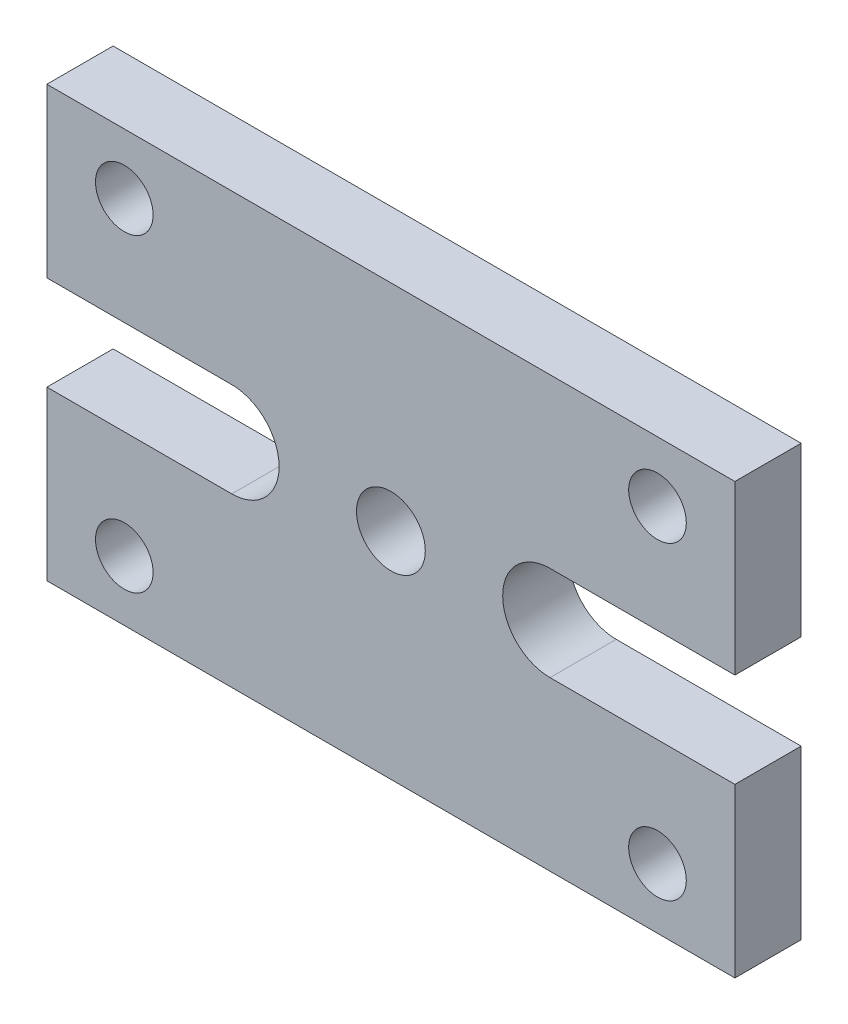
ISO-10303-21;
HEADER;
FILE_DESCRIPTION(('STEP AP214'),'2;1');
FILE_NAME('part.step','',(''),(''),'','','');
FILE_SCHEMA(('AUTOMOTIVE_DESIGN { 1 0 10303 214 1 1 1 1 }'));
ENDSEC;
DATA;
#1=APPLICATION_CONTEXT('core data for automotive mechanical design processes');
#2=APPLICATION_PROTOCOL_DEFINITION('international standard','automotive_design',2000,#1);
#3=PRODUCT_CONTEXT('',#1,'mechanical');
#4=PRODUCT('Part','Part','',(#3));
#5=PRODUCT_RELATED_PRODUCT_CATEGORY('part','',(#4));
#6=PRODUCT_DEFINITION_FORMATION('','',#4);
#7=PRODUCT_DEFINITION_CONTEXT('part definition',#1,'design');
#8=PRODUCT_DEFINITION('design','',#6,#7);
#9=PRODUCT_DEFINITION_SHAPE('','',#8);
#10=(LENGTH_UNIT() NAMED_UNIT(*) SI_UNIT(.MILLI.,.METRE.));
#11=(NAMED_UNIT(*) PLANE_ANGLE_UNIT() SI_UNIT($,.RADIAN.));
#12=(NAMED_UNIT(*) SI_UNIT($,.STERADIAN.) SOLID_ANGLE_UNIT());
#13=UNCERTAINTY_MEASURE_WITH_UNIT(LENGTH_MEASURE(1.E-05),#10,'distance_accuracy_value','');
#14=(GEOMETRIC_REPRESENTATION_CONTEXT(3) GLOBAL_UNCERTAINTY_ASSIGNED_CONTEXT((#13)) GLOBAL_UNIT_ASSIGNED_CONTEXT((#10,
#11,#12)) REPRESENTATION_CONTEXT('',''));
#15=CARTESIAN_POINT('',(0.,0.,0.));
#16=DIRECTION('',(0.,0.,1.));
#17=DIRECTION('',(1.,0.,0.));
#18=AXIS2_PLACEMENT_3D('',#15,#16,#17);
#19=CARTESIAN_POINT('',(-40.,25.,7.7));
#20=DIRECTION('',(1.,0.,0.));
#21=DIRECTION('',(0.,1.,0.));
#22=AXIS2_PLACEMENT_3D('',#19,#20,#21);
#23=PLANE('',#22);
#24=DIRECTION('',(0.,-1.,0.));
#25=VECTOR('',#24,1.);
#26=CARTESIAN_POINT('',(-40.,25.,0.));
#27=LINE('',#26,#25);
#28=CARTESIAN_POINT('',(-40.,25.,0.));
#29=VERTEX_POINT('',#28);
#30=CARTESIAN_POINT('',(-40.,5.5,0.));
#31=VERTEX_POINT('',#30);
#32=EDGE_CURVE('E152',#29,#31,#27,.T.);
#33=ORIENTED_EDGE('',*,*,#32,.T.);
#34=DIRECTION('',(0.,0.,-1.));
#35=VECTOR('',#34,1.);
#36=CARTESIAN_POINT('',(-40.,5.5,7.7));
#37=LINE('',#36,#35);
#38=CARTESIAN_POINT('',(-40.,5.5,7.7));
#39=VERTEX_POINT('',#38);
#40=EDGE_CURVE('E11',#39,#31,#37,.T.);
#41=ORIENTED_EDGE('',*,*,#40,.F.);
#42=DIRECTION('',(0.,-1.,0.));
#43=VECTOR('',#42,1.);
#44=CARTESIAN_POINT('',(-40.,25.,7.7));
#45=LINE('',#44,#43);
#46=CARTESIAN_POINT('',(-40.,25.,7.7));
#47=VERTEX_POINT('',#46);
#48=EDGE_CURVE('E175',#47,#39,#45,.T.);
#49=ORIENTED_EDGE('',*,*,#48,.F.);
#50=DIRECTION('',(0.,0.,-1.));
#51=VECTOR('',#50,1.);
#52=CARTESIAN_POINT('',(-40.,25.,7.7));
#53=LINE('',#52,#51);
#54=EDGE_CURVE('E148',#47,#29,#53,.T.);
#55=ORIENTED_EDGE('',*,*,#54,.T.);
#56=EDGE_LOOP('',(#33,#41,#49,#55));
#57=FACE_BOUND('',#56,.T.);
#58=ADVANCED_FACE('F32',(#57),#23,.F.);
#59=CARTESIAN_POINT('',(-18.5,5.5,7.7));
#60=DIRECTION('',(0.,1.,0.));
#61=DIRECTION('',(-1.,0.,0.));
#62=AXIS2_PLACEMENT_3D('',#59,#60,#61);
#63=PLANE('',#62);
#64=DIRECTION('',(1.,0.,0.));
#65=VECTOR('',#64,1.);
#66=CARTESIAN_POINT('',(-18.5,5.5,0.));
#67=LINE('',#66,#65);
#68=CARTESIAN_POINT('',(-18.5,5.5,0.));
#69=VERTEX_POINT('',#68);
#70=EDGE_CURVE('E155',#31,#69,#67,.T.);
#71=ORIENTED_EDGE('',*,*,#70,.T.);
#72=DIRECTION('',(0.,0.,-1.));
#73=VECTOR('',#72,1.);
#74=CARTESIAN_POINT('',(-18.5,5.5,7.7));
#75=LINE('',#74,#73);
#76=CARTESIAN_POINT('',(-18.5,5.5,7.7));
#77=VERTEX_POINT('',#76);
#78=EDGE_CURVE('E40',#77,#69,#75,.T.);
#79=ORIENTED_EDGE('',*,*,#78,.F.);
#80=DIRECTION('',(1.,0.,0.));
#81=VECTOR('',#80,1.);
#82=CARTESIAN_POINT('',(-18.5,5.5,7.7));
#83=LINE('',#82,#81);
#84=EDGE_CURVE('E103',#39,#77,#83,.T.);
#85=ORIENTED_EDGE('',*,*,#84,.F.);
#86=ORIENTED_EDGE('',*,*,#40,.T.);
#87=EDGE_LOOP('',(#71,#79,#85,#86));
#88=FACE_BOUND('',#87,.T.);
#89=ADVANCED_FACE('F254',(#88),#63,.F.);
#90=CARTESIAN_POINT('',(-18.5,0.,7.7));
#91=DIRECTION('',(0.,0.,-1.));
#92=DIRECTION('',(-1.,0.,0.));
#93=AXIS2_PLACEMENT_3D('',#90,#91,#92);
#94=CYLINDRICAL_SURFACE('',#93,5.5);
#95=CARTESIAN_POINT('',(-18.5,0.,0.));
#96=DIRECTION('',(0.,0.,-1.));
#97=DIRECTION('',(1.,0.,0.));
#98=AXIS2_PLACEMENT_3D('',#95,#96,#97);
#99=CIRCLE('',#98,5.5);
#100=CARTESIAN_POINT('',(-18.5,-5.5,0.));
#101=VERTEX_POINT('',#100);
#102=EDGE_CURVE('E158',#69,#101,#99,.T.);
#103=ORIENTED_EDGE('',*,*,#102,.T.);
#104=DIRECTION('',(0.,0.,-1.));
#105=VECTOR('',#104,1.);
#106=CARTESIAN_POINT('',(-18.5,-5.5,7.7));
#107=LINE('',#106,#105);
#108=CARTESIAN_POINT('',(-18.5,-5.5,7.7));
#109=VERTEX_POINT('',#108);
#110=EDGE_CURVE('E194',#109,#101,#107,.T.);
#111=ORIENTED_EDGE('',*,*,#110,.F.);
#112=CARTESIAN_POINT('',(-18.5,0.,7.7));
#113=DIRECTION('',(0.,0.,-1.));
#114=DIRECTION('',(1.,0.,0.));
#115=AXIS2_PLACEMENT_3D('',#112,#113,#114);
#116=CIRCLE('',#115,5.5);
#117=EDGE_CURVE('E202',#77,#109,#116,.T.);
#118=ORIENTED_EDGE('',*,*,#117,.F.);
#119=ORIENTED_EDGE('',*,*,#78,.T.);
#120=EDGE_LOOP('',(#103,#111,#118,#119));
#121=FACE_BOUND('',#120,.T.);
#122=ADVANCED_FACE('F200',(#121),#94,.F.);
#123=CARTESIAN_POINT('',(-18.5,-5.5,7.7));
#124=DIRECTION('',(0.,-1.,0.));
#125=DIRECTION('',(1.,0.,0.));
#126=AXIS2_PLACEMENT_3D('',#123,#124,#125);
#127=PLANE('',#126);
#128=DIRECTION('',(-1.,0.,0.));
#129=VECTOR('',#128,1.);
#130=CARTESIAN_POINT('',(-18.5,-5.5,0.));
#131=LINE('',#130,#129);
#132=CARTESIAN_POINT('',(-40.,-5.5,0.));
#133=VERTEX_POINT('',#132);
#134=EDGE_CURVE('E160',#101,#133,#131,.T.);
#135=ORIENTED_EDGE('',*,*,#134,.T.);
#136=DIRECTION('',(0.,0.,-1.));
#137=VECTOR('',#136,1.);
#138=CARTESIAN_POINT('',(-40.,-5.5,7.7));
#139=LINE('',#138,#137);
#140=CARTESIAN_POINT('',(-40.,-5.5,7.7));
#141=VERTEX_POINT('',#140);
#142=EDGE_CURVE('E191',#141,#133,#139,.T.);
#143=ORIENTED_EDGE('',*,*,#142,.F.);
#144=DIRECTION('',(-1.,0.,0.));
#145=VECTOR('',#144,1.);
#146=CARTESIAN_POINT('',(-18.5,-5.5,7.7));
#147=LINE('',#146,#145);
#148=EDGE_CURVE('E220',#109,#141,#147,.T.);
#149=ORIENTED_EDGE('',*,*,#148,.F.);
#150=ORIENTED_EDGE('',*,*,#110,.T.);
#151=EDGE_LOOP('',(#135,#143,#149,#150));
#152=FACE_BOUND('',#151,.T.);
#153=ADVANCED_FACE('F211',(#152),#127,.F.);
#154=CARTESIAN_POINT('',(-40.,-5.5,7.7));
#155=DIRECTION('',(1.,0.,0.));
#156=DIRECTION('',(0.,0.,-1.));
#157=AXIS2_PLACEMENT_3D('',#154,#155,#156);
#158=PLANE('',#157);
#159=DIRECTION('',(0.,-1.,0.));
#160=VECTOR('',#159,1.);
#161=CARTESIAN_POINT('',(-40.,-5.5,0.));
#162=LINE('',#161,#160);
#163=CARTESIAN_POINT('',(-40.,-25.,0.));
#164=VERTEX_POINT('',#163);
#165=EDGE_CURVE('E162',#133,#164,#162,.T.);
#166=ORIENTED_EDGE('',*,*,#165,.T.);
#167=DIRECTION('',(0.,0.,-1.));
#168=VECTOR('',#167,1.);
#169=CARTESIAN_POINT('',(-40.,-25.,7.7));
#170=LINE('',#169,#168);
#171=CARTESIAN_POINT('',(-40.,-25.,7.7));
#172=VERTEX_POINT('',#171);
#173=EDGE_CURVE('E188',#172,#164,#170,.T.);
#174=ORIENTED_EDGE('',*,*,#173,.F.);
#175=DIRECTION('',(0.,-1.,0.));
#176=VECTOR('',#175,1.);
#177=CARTESIAN_POINT('',(-40.,-5.5,7.7));
#178=LINE('',#177,#176);
#179=EDGE_CURVE('E217',#141,#172,#178,.T.);
#180=ORIENTED_EDGE('',*,*,#179,.F.);
#181=ORIENTED_EDGE('',*,*,#142,.T.);
#182=EDGE_LOOP('',(#166,#174,#180,#181));
#183=FACE_BOUND('',#182,.T.);
#184=ADVANCED_FACE('F215',(#183),#158,.F.);
#185=CARTESIAN_POINT('',(-40.,-25.,7.7));
#186=DIRECTION('',(0.,1.,0.));
#187=DIRECTION('',(0.,0.,1.));
#188=AXIS2_PLACEMENT_3D('',#185,#186,#187);
#189=PLANE('',#188);
#190=DIRECTION('',(1.,0.,0.));
#191=VECTOR('',#190,1.);
#192=CARTESIAN_POINT('',(-40.,-25.,0.));
#193=LINE('',#192,#191);
#194=CARTESIAN_POINT('',(40.,-25.,0.));
#195=VERTEX_POINT('',#194);
#196=EDGE_CURVE('E164',#164,#195,#193,.T.);
#197=ORIENTED_EDGE('',*,*,#196,.T.);
#198=DIRECTION('',(0.,0.,-1.));
#199=VECTOR('',#198,1.);
#200=CARTESIAN_POINT('',(40.,-25.,7.7));
#201=LINE('',#200,#199);
#202=CARTESIAN_POINT('',(40.,-25.,7.7));
#203=VERTEX_POINT('',#202);
#204=EDGE_CURVE('E185',#203,#195,#201,.T.);
#205=ORIENTED_EDGE('',*,*,#204,.F.);
#206=DIRECTION('',(1.,0.,0.));
#207=VECTOR('',#206,1.);
#208=CARTESIAN_POINT('',(-40.,-25.,7.7));
#209=LINE('',#208,#207);
#210=EDGE_CURVE('E219',#172,#203,#209,.T.);
#211=ORIENTED_EDGE('',*,*,#210,.F.);
#212=ORIENTED_EDGE('',*,*,#173,.T.);
#213=EDGE_LOOP('',(#197,#205,#211,#212));
#214=FACE_BOUND('',#213,.T.);
#215=ADVANCED_FACE('F267',(#214),#189,.F.);
#216=CARTESIAN_POINT('',(40.,-5.5,7.7));
#217=DIRECTION('',(-1.,0.,0.));
#218=DIRECTION('',(0.,0.,1.));
#219=AXIS2_PLACEMENT_3D('',#216,#217,#218);
#220=PLANE('',#219);
#221=DIRECTION('',(0.,1.,0.));
#222=VECTOR('',#221,1.);
#223=CARTESIAN_POINT('',(40.,-5.5,0.));
#224=LINE('',#223,#222);
#225=CARTESIAN_POINT('',(40.,-5.5,0.));
#226=VERTEX_POINT('',#225);
#227=EDGE_CURVE('E166',#195,#226,#224,.T.);
#228=ORIENTED_EDGE('',*,*,#227,.T.);
#229=DIRECTION('',(0.,0.,-1.));
#230=VECTOR('',#229,1.);
#231=CARTESIAN_POINT('',(40.,-5.5,7.7));
#232=LINE('',#231,#230);
#233=CARTESIAN_POINT('',(40.,-5.5,7.7));
#234=VERTEX_POINT('',#233);
#235=EDGE_CURVE('E182',#234,#226,#232,.T.);
#236=ORIENTED_EDGE('',*,*,#235,.F.);
#237=DIRECTION('',(0.,1.,0.));
#238=VECTOR('',#237,1.);
#239=CARTESIAN_POINT('',(40.,-5.5,7.7));
#240=LINE('',#239,#238);
#241=EDGE_CURVE('E222',#203,#234,#240,.T.);
#242=ORIENTED_EDGE('',*,*,#241,.F.);
#243=ORIENTED_EDGE('',*,*,#204,.T.);
#244=EDGE_LOOP('',(#228,#236,#242,#243));
#245=FACE_BOUND('',#244,.T.);
#246=ADVANCED_FACE('F270',(#245),#220,.F.);
#247=CARTESIAN_POINT('',(18.5,-5.5,7.7));
#248=DIRECTION('',(0.,-1.,0.));
#249=DIRECTION('',(1.,0.,0.));
#250=AXIS2_PLACEMENT_3D('',#247,#248,#249);
#251=PLANE('',#250);
#252=DIRECTION('',(-1.,0.,0.));
#253=VECTOR('',#252,1.);
#254=CARTESIAN_POINT('',(18.5,-5.5,0.));
#255=LINE('',#254,#253);
#256=CARTESIAN_POINT('',(18.5,-5.5,0.));
#257=VERTEX_POINT('',#256);
#258=EDGE_CURVE('E168',#226,#257,#255,.T.);
#259=ORIENTED_EDGE('',*,*,#258,.T.);
#260=DIRECTION('',(0.,0.,-1.));
#261=VECTOR('',#260,1.);
#262=CARTESIAN_POINT('',(18.5,-5.5,7.7));
#263=LINE('',#262,#261);
#264=CARTESIAN_POINT('',(18.5,-5.5,7.7));
#265=VERTEX_POINT('',#264);
#266=EDGE_CURVE('E179',#265,#257,#263,.T.);
#267=ORIENTED_EDGE('',*,*,#266,.F.);
#268=DIRECTION('',(-1.,0.,0.));
#269=VECTOR('',#268,1.);
#270=CARTESIAN_POINT('',(18.5,-5.5,7.7));
#271=LINE('',#270,#269);
#272=EDGE_CURVE('E228',#234,#265,#271,.T.);
#273=ORIENTED_EDGE('',*,*,#272,.F.);
#274=ORIENTED_EDGE('',*,*,#235,.T.);
#275=EDGE_LOOP('',(#259,#267,#273,#274));
#276=FACE_BOUND('',#275,.T.);
#277=ADVANCED_FACE('F234',(#276),#251,.F.);
#278=CARTESIAN_POINT('',(18.5,0.,7.7));
#279=DIRECTION('',(0.,0.,-1.));
#280=DIRECTION('',(-1.,0.,0.));
#281=AXIS2_PLACEMENT_3D('',#278,#279,#280);
#282=CYLINDRICAL_SURFACE('',#281,5.5);
#283=CARTESIAN_POINT('',(18.5,0.,0.));
#284=DIRECTION('',(0.,0.,-1.));
#285=DIRECTION('',(1.,0.,0.));
#286=AXIS2_PLACEMENT_3D('',#283,#284,#285);
#287=CIRCLE('',#286,5.5);
#288=CARTESIAN_POINT('',(18.5,5.5,0.));
#289=VERTEX_POINT('',#288);
#290=EDGE_CURVE('E170',#257,#289,#287,.T.);
#291=ORIENTED_EDGE('',*,*,#290,.T.);
#292=DIRECTION('',(0.,0.,-1.));
#293=VECTOR('',#292,1.);
#294=CARTESIAN_POINT('',(18.5,5.5,7.7));
#295=LINE('',#294,#293);
#296=CARTESIAN_POINT('',(18.5,5.5,7.7));
#297=VERTEX_POINT('',#296);
#298=EDGE_CURVE('E143',#297,#289,#295,.T.);
#299=ORIENTED_EDGE('',*,*,#298,.F.);
#300=CARTESIAN_POINT('',(18.5,0.,7.7));
#301=DIRECTION('',(0.,0.,-1.));
#302=DIRECTION('',(1.,0.,0.));
#303=AXIS2_PLACEMENT_3D('',#300,#301,#302);
#304=CIRCLE('',#303,5.5);
#305=EDGE_CURVE('E134',#265,#297,#304,.T.);
#306=ORIENTED_EDGE('',*,*,#305,.F.);
#307=ORIENTED_EDGE('',*,*,#266,.T.);
#308=EDGE_LOOP('',(#291,#299,#306,#307));
#309=FACE_BOUND('',#308,.T.);
#310=ADVANCED_FACE('F238',(#309),#282,.F.);
#311=CARTESIAN_POINT('',(18.5,5.5,7.7));
#312=DIRECTION('',(0.,1.,0.));
#313=DIRECTION('',(-1.,0.,0.));
#314=AXIS2_PLACEMENT_3D('',#311,#312,#313);
#315=PLANE('',#314);
#316=DIRECTION('',(1.,0.,0.));
#317=VECTOR('',#316,1.);
#318=CARTESIAN_POINT('',(18.5,5.5,0.));
#319=LINE('',#318,#317);
#320=CARTESIAN_POINT('',(40.,5.5,0.));
#321=VERTEX_POINT('',#320);
#322=EDGE_CURVE('E142',#289,#321,#319,.T.);
#323=ORIENTED_EDGE('',*,*,#322,.T.);
#324=DIRECTION('',(0.,0.,-1.));
#325=VECTOR('',#324,1.);
#326=CARTESIAN_POINT('',(40.,5.5,7.7));
#327=LINE('',#326,#325);
#328=CARTESIAN_POINT('',(40.,5.5,7.7));
#329=VERTEX_POINT('',#328);
#330=EDGE_CURVE('E139',#329,#321,#327,.T.);
#331=ORIENTED_EDGE('',*,*,#330,.F.);
#332=DIRECTION('',(1.,0.,0.));
#333=VECTOR('',#332,1.);
#334=CARTESIAN_POINT('',(18.5,5.5,7.7));
#335=LINE('',#334,#333);
#336=EDGE_CURVE('E128',#297,#329,#335,.T.);
#337=ORIENTED_EDGE('',*,*,#336,.F.);
#338=ORIENTED_EDGE('',*,*,#298,.T.);
#339=EDGE_LOOP('',(#323,#331,#337,#338));
#340=FACE_BOUND('',#339,.T.);
#341=ADVANCED_FACE('F140',(#340),#315,.F.);
#342=CARTESIAN_POINT('',(40.,25.,7.7));
#343=DIRECTION('',(-1.,0.,0.));
#344=DIRECTION('',(0.,-1.,0.));
#345=AXIS2_PLACEMENT_3D('',#342,#343,#344);
#346=PLANE('',#345);
#347=DIRECTION('',(0.,1.,0.));
#348=VECTOR('',#347,1.);
#349=CARTESIAN_POINT('',(40.,25.,0.));
#350=LINE('',#349,#348);
#351=CARTESIAN_POINT('',(40.,25.,0.));
#352=VERTEX_POINT('',#351);
#353=EDGE_CURVE('E89',#321,#352,#350,.T.);
#354=ORIENTED_EDGE('',*,*,#353,.T.);
#355=DIRECTION('',(0.,0.,-1.));
#356=VECTOR('',#355,1.);
#357=CARTESIAN_POINT('',(40.,25.,7.7));
#358=LINE('',#357,#356);
#359=CARTESIAN_POINT('',(40.,25.,7.7));
#360=VERTEX_POINT('',#359);
#361=EDGE_CURVE('E144',#360,#352,#358,.T.);
#362=ORIENTED_EDGE('',*,*,#361,.F.);
#363=DIRECTION('',(0.,1.,0.));
#364=VECTOR('',#363,1.);
#365=CARTESIAN_POINT('',(40.,25.,7.7));
#366=LINE('',#365,#364);
#367=EDGE_CURVE('E132',#329,#360,#366,.T.);
#368=ORIENTED_EDGE('',*,*,#367,.F.);
#369=ORIENTED_EDGE('',*,*,#330,.T.);
#370=EDGE_LOOP('',(#354,#362,#368,#369));
#371=FACE_BOUND('',#370,.T.);
#372=ADVANCED_FACE('F146',(#371),#346,.F.);
#373=CARTESIAN_POINT('',(-40.,25.,7.7));
#374=DIRECTION('',(0.,-1.,0.));
#375=DIRECTION('',(0.,0.,-1.));
#376=AXIS2_PLACEMENT_3D('',#373,#374,#375);
#377=PLANE('',#376);
#378=DIRECTION('',(-1.,0.,0.));
#379=VECTOR('',#378,1.);
#380=CARTESIAN_POINT('',(-40.,25.,0.));
#381=LINE('',#380,#379);
#382=EDGE_CURVE('E95',#352,#29,#381,.T.);
#383=ORIENTED_EDGE('',*,*,#382,.T.);
#384=ORIENTED_EDGE('',*,*,#54,.F.);
#385=DIRECTION('',(-1.,0.,0.));
#386=VECTOR('',#385,1.);
#387=CARTESIAN_POINT('',(-40.,25.,7.7));
#388=LINE('',#387,#386);
#389=EDGE_CURVE('E48',#360,#47,#388,.T.);
#390=ORIENTED_EDGE('',*,*,#389,.F.);
#391=ORIENTED_EDGE('',*,*,#361,.T.);
#392=EDGE_LOOP('',(#383,#384,#390,#391));
#393=FACE_BOUND('',#392,.T.);
#394=ADVANCED_FACE('F242',(#393),#377,.F.);
#395=CARTESIAN_POINT('',(-18.5,0.,7.7));
#396=DIRECTION('',(0.,0.,1.));
#397=DIRECTION('',(1.,0.,0.));
#398=AXIS2_PLACEMENT_3D('',#395,#396,#397);
#399=PLANE('',#398);
#400=CARTESIAN_POINT('',(0.,0.,7.7));
#401=DIRECTION('',(0.,0.,1.));
#402=DIRECTION('',(1.,0.,0.));
#403=AXIS2_PLACEMENT_3D('',#400,#401,#402);
#404=CIRCLE('',#403,3.99999999999999);
#405=CARTESIAN_POINT('',(3.99999999999999,0.,7.7));
#406=VERTEX_POINT('',#405);
#407=EDGE_CURVE('E366',#406,#406,#404,.T.);
#408=ORIENTED_EDGE('',*,*,#407,.F.);
#409=EDGE_LOOP('',(#408));
#410=FACE_BOUND('',#409,.T.);
#411=CARTESIAN_POINT('',(31.,18.,7.7));
#412=DIRECTION('',(0.,0.,1.));
#413=DIRECTION('',(1.,0.,0.));
#414=AXIS2_PLACEMENT_3D('',#411,#412,#413);
#415=CIRCLE('',#414,3.34999999999999);
#416=CARTESIAN_POINT('',(34.35,18.,7.7));
#417=VERTEX_POINT('',#416);
#418=EDGE_CURVE('E368',#417,#417,#415,.T.);
#419=ORIENTED_EDGE('',*,*,#418,.F.);
#420=EDGE_LOOP('',(#419));
#421=FACE_BOUND('',#420,.T.);
#422=CARTESIAN_POINT('',(-31.,18.,7.7));
#423=DIRECTION('',(0.,0.,1.));
#424=DIRECTION('',(1.,0.,0.));
#425=AXIS2_PLACEMENT_3D('',#422,#423,#424);
#426=CIRCLE('',#425,3.34999999999999);
#427=CARTESIAN_POINT('',(-27.65,18.,7.7));
#428=VERTEX_POINT('',#427);
#429=EDGE_CURVE('E376',#428,#428,#426,.T.);
#430=ORIENTED_EDGE('',*,*,#429,.F.);
#431=EDGE_LOOP('',(#430));
#432=FACE_BOUND('',#431,.T.);
#433=CARTESIAN_POINT('',(-31.,-18.,7.7));
#434=DIRECTION('',(0.,0.,1.));
#435=DIRECTION('',(1.,0.,0.));
#436=AXIS2_PLACEMENT_3D('',#433,#434,#435);
#437=CIRCLE('',#436,3.34999999999999);
#438=CARTESIAN_POINT('',(-27.65,-18.,7.7));
#439=VERTEX_POINT('',#438);
#440=EDGE_CURVE('E382',#439,#439,#437,.T.);
#441=ORIENTED_EDGE('',*,*,#440,.F.);
#442=EDGE_LOOP('',(#441));
#443=FACE_BOUND('',#442,.T.);
#444=CARTESIAN_POINT('',(31.,-18.,7.7));
#445=DIRECTION('',(0.,0.,1.));
#446=DIRECTION('',(1.,0.,0.));
#447=AXIS2_PLACEMENT_3D('',#444,#445,#446);
#448=CIRCLE('',#447,3.34999999999999);
#449=CARTESIAN_POINT('',(34.35,-18.,7.7));
#450=VERTEX_POINT('',#449);
#451=EDGE_CURVE('E388',#450,#450,#448,.T.);
#452=ORIENTED_EDGE('',*,*,#451,.F.);
#453=EDGE_LOOP('',(#452));
#454=FACE_BOUND('',#453,.T.);
#455=ORIENTED_EDGE('',*,*,#48,.T.);
#456=ORIENTED_EDGE('',*,*,#84,.T.);
#457=ORIENTED_EDGE('',*,*,#117,.T.);
#458=ORIENTED_EDGE('',*,*,#148,.T.);
#459=ORIENTED_EDGE('',*,*,#179,.T.);
#460=ORIENTED_EDGE('',*,*,#210,.T.);
#461=ORIENTED_EDGE('',*,*,#241,.T.);
#462=ORIENTED_EDGE('',*,*,#272,.T.);
#463=ORIENTED_EDGE('',*,*,#305,.T.);
#464=ORIENTED_EDGE('',*,*,#336,.T.);
#465=ORIENTED_EDGE('',*,*,#367,.T.);
#466=ORIENTED_EDGE('',*,*,#389,.T.);
#467=EDGE_LOOP('',(#455,#456,#457,#458,#459,#460,#461,#462,#463,#464,#465,#466));
#468=FACE_BOUND('',#467,.T.);
#469=ADVANCED_FACE('F130',(#410,#421,#432,#443,#454,#468),#399,.T.);
#470=CARTESIAN_POINT('',(-18.5,0.,0.));
#471=DIRECTION('',(0.,0.,1.));
#472=DIRECTION('',(1.,0.,0.));
#473=AXIS2_PLACEMENT_3D('',#470,#471,#472);
#474=PLANE('',#473);
#475=CARTESIAN_POINT('',(0.,0.,0.));
#476=DIRECTION('',(0.,0.,1.));
#477=DIRECTION('',(1.,0.,0.));
#478=AXIS2_PLACEMENT_3D('',#475,#476,#477);
#479=CIRCLE('',#478,3.99999999999999);
#480=CARTESIAN_POINT('',(3.99999999999999,0.,0.));
#481=VERTEX_POINT('',#480);
#482=EDGE_CURVE('E363',#481,#481,#479,.T.);
#483=ORIENTED_EDGE('',*,*,#482,.T.);
#484=EDGE_LOOP('',(#483));
#485=FACE_BOUND('',#484,.T.);
#486=CARTESIAN_POINT('',(31.,18.,0.));
#487=DIRECTION('',(0.,0.,1.));
#488=DIRECTION('',(1.,0.,0.));
#489=AXIS2_PLACEMENT_3D('',#486,#487,#488);
#490=CIRCLE('',#489,3.34999999999999);
#491=CARTESIAN_POINT('',(34.35,18.,0.));
#492=VERTEX_POINT('',#491);
#493=EDGE_CURVE('E373',#492,#492,#490,.T.);
#494=ORIENTED_EDGE('',*,*,#493,.T.);
#495=EDGE_LOOP('',(#494));
#496=FACE_BOUND('',#495,.T.);
#497=CARTESIAN_POINT('',(-31.,18.,0.));
#498=DIRECTION('',(0.,0.,1.));
#499=DIRECTION('',(1.,0.,0.));
#500=AXIS2_PLACEMENT_3D('',#497,#498,#499);
#501=CIRCLE('',#500,3.34999999999999);
#502=CARTESIAN_POINT('',(-27.65,18.,0.));
#503=VERTEX_POINT('',#502);
#504=EDGE_CURVE('E379',#503,#503,#501,.T.);
#505=ORIENTED_EDGE('',*,*,#504,.T.);
#506=EDGE_LOOP('',(#505));
#507=FACE_BOUND('',#506,.T.);
#508=CARTESIAN_POINT('',(-31.,-18.,0.));
#509=DIRECTION('',(0.,0.,1.));
#510=DIRECTION('',(1.,0.,0.));
#511=AXIS2_PLACEMENT_3D('',#508,#509,#510);
#512=CIRCLE('',#511,3.34999999999999);
#513=CARTESIAN_POINT('',(-27.65,-18.,0.));
#514=VERTEX_POINT('',#513);
#515=EDGE_CURVE('E385',#514,#514,#512,.T.);
#516=ORIENTED_EDGE('',*,*,#515,.T.);
#517=EDGE_LOOP('',(#516));
#518=FACE_BOUND('',#517,.T.);
#519=CARTESIAN_POINT('',(31.,-18.,0.));
#520=DIRECTION('',(0.,0.,1.));
#521=DIRECTION('',(1.,0.,0.));
#522=AXIS2_PLACEMENT_3D('',#519,#520,#521);
#523=CIRCLE('',#522,3.34999999999999);
#524=CARTESIAN_POINT('',(34.35,-18.,0.));
#525=VERTEX_POINT('',#524);
#526=EDGE_CURVE('E156',#525,#525,#523,.T.);
#527=ORIENTED_EDGE('',*,*,#526,.T.);
#528=EDGE_LOOP('',(#527));
#529=FACE_BOUND('',#528,.T.);
#530=ORIENTED_EDGE('',*,*,#32,.F.);
#531=ORIENTED_EDGE('',*,*,#382,.F.);
#532=ORIENTED_EDGE('',*,*,#353,.F.);
#533=ORIENTED_EDGE('',*,*,#322,.F.);
#534=ORIENTED_EDGE('',*,*,#290,.F.);
#535=ORIENTED_EDGE('',*,*,#258,.F.);
#536=ORIENTED_EDGE('',*,*,#227,.F.);
#537=ORIENTED_EDGE('',*,*,#196,.F.);
#538=ORIENTED_EDGE('',*,*,#165,.F.);
#539=ORIENTED_EDGE('',*,*,#134,.F.);
#540=ORIENTED_EDGE('',*,*,#102,.F.);
#541=ORIENTED_EDGE('',*,*,#70,.F.);
#542=EDGE_LOOP('',(#530,#531,#532,#533,#534,#535,#536,#537,#538,#539,#540,#541));
#543=FACE_BOUND('',#542,.T.);
#544=ADVANCED_FACE('F206',(#485,#496,#507,#518,#529,#543),#474,.F.);
#545=CARTESIAN_POINT('',(31.,-18.,7.7));
#546=DIRECTION('',(0.,0.,1.));
#547=DIRECTION('',(1.,0.,0.));
#548=AXIS2_PLACEMENT_3D('',#545,#546,#547);
#549=CYLINDRICAL_SURFACE('',#548,3.34999999999999);
#550=ORIENTED_EDGE('',*,*,#526,.F.);
#551=EDGE_LOOP('',(#550));
#552=FACE_BOUND('',#551,.T.);
#553=ORIENTED_EDGE('',*,*,#451,.T.);
#554=EDGE_LOOP('',(#553));
#555=FACE_BOUND('',#554,.T.);
#556=ADVANCED_FACE('F298',(#552,#555),#549,.F.);
#557=CARTESIAN_POINT('',(-31.,-18.,7.7));
#558=DIRECTION('',(0.,0.,1.));
#559=DIRECTION('',(1.,0.,0.));
#560=AXIS2_PLACEMENT_3D('',#557,#558,#559);
#561=CYLINDRICAL_SURFACE('',#560,3.34999999999999);
#562=ORIENTED_EDGE('',*,*,#515,.F.);
#563=EDGE_LOOP('',(#562));
#564=FACE_BOUND('',#563,.T.);
#565=ORIENTED_EDGE('',*,*,#440,.T.);
#566=EDGE_LOOP('',(#565));
#567=FACE_BOUND('',#566,.T.);
#568=ADVANCED_FACE('F303',(#564,#567),#561,.F.);
#569=CARTESIAN_POINT('',(-31.,18.,7.7));
#570=DIRECTION('',(0.,0.,1.));
#571=DIRECTION('',(1.,0.,0.));
#572=AXIS2_PLACEMENT_3D('',#569,#570,#571);
#573=CYLINDRICAL_SURFACE('',#572,3.34999999999999);
#574=ORIENTED_EDGE('',*,*,#504,.F.);
#575=EDGE_LOOP('',(#574));
#576=FACE_BOUND('',#575,.T.);
#577=ORIENTED_EDGE('',*,*,#429,.T.);
#578=EDGE_LOOP('',(#577));
#579=FACE_BOUND('',#578,.T.);
#580=ADVANCED_FACE('F315',(#576,#579),#573,.F.);
#581=CARTESIAN_POINT('',(31.,18.,7.7));
#582=DIRECTION('',(0.,0.,1.));
#583=DIRECTION('',(1.,0.,0.));
#584=AXIS2_PLACEMENT_3D('',#581,#582,#583);
#585=CYLINDRICAL_SURFACE('',#584,3.34999999999999);
#586=ORIENTED_EDGE('',*,*,#493,.F.);
#587=EDGE_LOOP('',(#586));
#588=FACE_BOUND('',#587,.T.);
#589=ORIENTED_EDGE('',*,*,#418,.T.);
#590=EDGE_LOOP('',(#589));
#591=FACE_BOUND('',#590,.T.);
#592=ADVANCED_FACE('F325',(#588,#591),#585,.F.);
#593=CARTESIAN_POINT('',(0.,0.,7.7));
#594=DIRECTION('',(0.,0.,1.));
#595=DIRECTION('',(1.,0.,0.));
#596=AXIS2_PLACEMENT_3D('',#593,#594,#595);
#597=CYLINDRICAL_SURFACE('',#596,3.99999999999999);
#598=ORIENTED_EDGE('',*,*,#482,.F.);
#599=EDGE_LOOP('',(#598));
#600=FACE_BOUND('',#599,.T.);
#601=ORIENTED_EDGE('',*,*,#407,.T.);
#602=EDGE_LOOP('',(#601));
#603=FACE_BOUND('',#602,.T.);
#604=ADVANCED_FACE('F335',(#600,#603),#597,.F.);
#605=CLOSED_SHELL('',(#58,#89,#122,#153,#184,#215,#246,#277,#310,#341,#372,#394,#469,#544,#556,
#568,#580,#592,#604));
#606=MANIFOLD_SOLID_BREP('B2',#605);
#607=ADVANCED_BREP_SHAPE_REPRESENTATION('',(#18,#606),#14);
#608=SHAPE_DEFINITION_REPRESENTATION(#9,#607);
ENDSEC;
END-ISO-10303-21;
